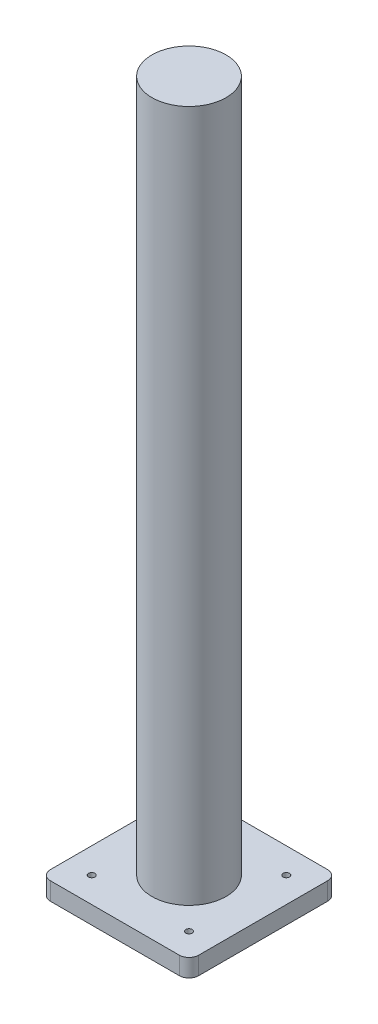
ISO-10303-21;
HEADER;
FILE_DESCRIPTION(('STEP AP214'),'2;1');
FILE_NAME('part.step','',(''),(''),'','','');
FILE_SCHEMA(('AUTOMOTIVE_DESIGN { 1 0 10303 214 1 1 1 1 }'));
ENDSEC;
DATA;
#1=APPLICATION_CONTEXT('core data for automotive mechanical design processes');
#2=APPLICATION_PROTOCOL_DEFINITION('international standard','automotive_design',2000,#1);
#3=PRODUCT_CONTEXT('',#1,'mechanical');
#4=PRODUCT('Part','Part','',(#3));
#5=PRODUCT_RELATED_PRODUCT_CATEGORY('part','',(#4));
#6=PRODUCT_DEFINITION_FORMATION('','',#4);
#7=PRODUCT_DEFINITION_CONTEXT('part definition',#1,'design');
#8=PRODUCT_DEFINITION('design','',#6,#7);
#9=PRODUCT_DEFINITION_SHAPE('','',#8);
#10=(LENGTH_UNIT() NAMED_UNIT(*) SI_UNIT(.MILLI.,.METRE.));
#11=(NAMED_UNIT(*) PLANE_ANGLE_UNIT() SI_UNIT($,.RADIAN.));
#12=(NAMED_UNIT(*) SI_UNIT($,.STERADIAN.) SOLID_ANGLE_UNIT());
#13=UNCERTAINTY_MEASURE_WITH_UNIT(LENGTH_MEASURE(1.E-05),#10,'distance_accuracy_value','');
#14=(GEOMETRIC_REPRESENTATION_CONTEXT(3) GLOBAL_UNCERTAINTY_ASSIGNED_CONTEXT((#13)) GLOBAL_UNIT_ASSIGNED_CONTEXT((#10,
#11,#12)) REPRESENTATION_CONTEXT('',''));
#15=CARTESIAN_POINT('',(0.,0.,0.));
#16=DIRECTION('',(0.,0.,1.));
#17=DIRECTION('',(1.,0.,0.));
#18=AXIS2_PLACEMENT_3D('',#15,#16,#17);
#19=CARTESIAN_POINT('',(0.,0.,0.));
#20=DIRECTION('',(0.,-1.,0.));
#21=DIRECTION('',(0.,0.,-1.));
#22=AXIS2_PLACEMENT_3D('',#19,#20,#21);
#23=PLANE('',#22);
#24=DIRECTION('',(-1.,0.,0.));
#25=VECTOR('',#24,1.);
#26=CARTESIAN_POINT('',(0.,0.,0.));
#27=LINE('',#26,#25);
#28=CARTESIAN_POINT('',(71.2,0.,0.));
#29=VERTEX_POINT('',#28);
#30=CARTESIAN_POINT('',(5.,0.,0.));
#31=VERTEX_POINT('',#30);
#32=EDGE_CURVE('E108',#29,#31,#27,.T.);
#33=ORIENTED_EDGE('',*,*,#32,.T.);
#34=CARTESIAN_POINT('',(5.,0.,-5.));
#35=DIRECTION('',(0.,-1.,0.));
#36=DIRECTION('',(0.,0.,-1.));
#37=AXIS2_PLACEMENT_3D('',#34,#35,#36);
#38=CIRCLE('',#37,5.);
#39=CARTESIAN_POINT('',(0.,0.,-5.));
#40=VERTEX_POINT('',#39);
#41=EDGE_CURVE('E140',#40,#31,#38,.F.);
#42=ORIENTED_EDGE('',*,*,#41,.F.);
#43=DIRECTION('',(0.,0.,-1.));
#44=VECTOR('',#43,1.);
#45=CARTESIAN_POINT('',(0.,0.,0.));
#46=LINE('',#45,#44);
#47=CARTESIAN_POINT('',(0.,0.,-71.2));
#48=VERTEX_POINT('',#47);
#49=EDGE_CURVE('E139',#40,#48,#46,.T.);
#50=ORIENTED_EDGE('',*,*,#49,.T.);
#51=CARTESIAN_POINT('',(5.,0.,-71.2));
#52=DIRECTION('',(0.,-1.,0.));
#53=DIRECTION('',(0.,0.,-1.));
#54=AXIS2_PLACEMENT_3D('',#51,#52,#53);
#55=CIRCLE('',#54,5.);
#56=CARTESIAN_POINT('',(5.,0.,-76.2));
#57=VERTEX_POINT('',#56);
#58=EDGE_CURVE('E135',#57,#48,#55,.F.);
#59=ORIENTED_EDGE('',*,*,#58,.F.);
#60=DIRECTION('',(1.,0.,0.));
#61=VECTOR('',#60,1.);
#62=CARTESIAN_POINT('',(0.,0.,-76.2));
#63=LINE('',#62,#61);
#64=CARTESIAN_POINT('',(71.2,0.,-76.2));
#65=VERTEX_POINT('',#64);
#66=EDGE_CURVE('E87',#57,#65,#63,.T.);
#67=ORIENTED_EDGE('',*,*,#66,.T.);
#68=CARTESIAN_POINT('',(71.2,0.,-71.2));
#69=DIRECTION('',(0.,-1.,0.));
#70=DIRECTION('',(0.,0.,-1.));
#71=AXIS2_PLACEMENT_3D('',#68,#69,#70);
#72=CIRCLE('',#71,5.);
#73=CARTESIAN_POINT('',(76.2,0.,-71.2));
#74=VERTEX_POINT('',#73);
#75=EDGE_CURVE('E80',#74,#65,#72,.F.);
#76=ORIENTED_EDGE('',*,*,#75,.F.);
#77=DIRECTION('',(0.,0.,1.));
#78=VECTOR('',#77,1.);
#79=CARTESIAN_POINT('',(76.2,0.,0.));
#80=LINE('',#79,#78);
#81=CARTESIAN_POINT('',(76.2,0.,-5.));
#82=VERTEX_POINT('',#81);
#83=EDGE_CURVE('E84',#74,#82,#80,.T.);
#84=ORIENTED_EDGE('',*,*,#83,.T.);
#85=CARTESIAN_POINT('',(71.2,0.,-5.));
#86=DIRECTION('',(0.,-1.,0.));
#87=DIRECTION('',(0.,0.,-1.));
#88=AXIS2_PLACEMENT_3D('',#85,#86,#87);
#89=CIRCLE('',#88,5.);
#90=EDGE_CURVE('E104',#29,#82,#89,.F.);
#91=ORIENTED_EDGE('',*,*,#90,.F.);
#92=EDGE_LOOP('',(#33,#42,#50,#59,#67,#76,#84,#91));
#93=FACE_BOUND('',#92,.T.);
#94=CARTESIAN_POINT('',(63.1,0.,-63.1));
#95=DIRECTION('',(0.,1.,0.));
#96=DIRECTION('',(0.,0.,1.));
#97=AXIS2_PLACEMENT_3D('',#94,#95,#96);
#98=CIRCLE('',#97,1.65);
#99=CARTESIAN_POINT('',(63.1,0.,-61.45));
#100=VERTEX_POINT('',#99);
#101=EDGE_CURVE('E91',#100,#100,#98,.T.);
#102=ORIENTED_EDGE('',*,*,#101,.T.);
#103=EDGE_LOOP('',(#102));
#104=FACE_BOUND('',#103,.T.);
#105=CARTESIAN_POINT('',(13.1,0.,-13.1));
#106=DIRECTION('',(0.,1.,0.));
#107=DIRECTION('',(0.,0.,1.));
#108=AXIS2_PLACEMENT_3D('',#105,#106,#107);
#109=CIRCLE('',#108,1.65);
#110=CARTESIAN_POINT('',(13.1,0.,-11.45));
#111=VERTEX_POINT('',#110);
#112=EDGE_CURVE('E146',#111,#111,#109,.T.);
#113=ORIENTED_EDGE('',*,*,#112,.T.);
#114=EDGE_LOOP('',(#113));
#115=FACE_BOUND('',#114,.T.);
#116=CARTESIAN_POINT('',(63.1,0.,-13.1));
#117=DIRECTION('',(0.,1.,0.));
#118=DIRECTION('',(0.,0.,1.));
#119=AXIS2_PLACEMENT_3D('',#116,#117,#118);
#120=CIRCLE('',#119,1.65);
#121=CARTESIAN_POINT('',(63.1,0.,-11.45));
#122=VERTEX_POINT('',#121);
#123=EDGE_CURVE('E148',#122,#122,#120,.T.);
#124=ORIENTED_EDGE('',*,*,#123,.T.);
#125=EDGE_LOOP('',(#124));
#126=FACE_BOUND('',#125,.T.);
#127=CARTESIAN_POINT('',(13.1,0.,-63.1));
#128=DIRECTION('',(0.,1.,0.));
#129=DIRECTION('',(0.,0.,1.));
#130=AXIS2_PLACEMENT_3D('',#127,#128,#129);
#131=CIRCLE('',#130,1.65);
#132=CARTESIAN_POINT('',(13.1,0.,-61.45));
#133=VERTEX_POINT('',#132);
#134=EDGE_CURVE('E20',#133,#133,#131,.T.);
#135=ORIENTED_EDGE('',*,*,#134,.T.);
#136=EDGE_LOOP('',(#135));
#137=FACE_BOUND('',#136,.T.);
#138=ADVANCED_FACE('F17',(#93,#104,#115,#126,#137),#23,.T.);
#139=CARTESIAN_POINT('',(13.1,0.,-63.1));
#140=DIRECTION('',(0.,1.,0.));
#141=DIRECTION('',(0.,0.,1.));
#142=AXIS2_PLACEMENT_3D('',#139,#140,#141);
#143=CYLINDRICAL_SURFACE('',#142,1.65);
#144=ORIENTED_EDGE('',*,*,#134,.F.);
#145=EDGE_LOOP('',(#144));
#146=FACE_BOUND('',#145,.T.);
#147=CARTESIAN_POINT('',(13.1,9.144,-63.1));
#148=DIRECTION('',(0.,1.,0.));
#149=DIRECTION('',(0.,0.,1.));
#150=AXIS2_PLACEMENT_3D('',#147,#148,#149);
#151=CIRCLE('',#150,1.65);
#152=CARTESIAN_POINT('',(13.1,9.144,-61.45));
#153=VERTEX_POINT('',#152);
#154=EDGE_CURVE('E132',#153,#153,#151,.T.);
#155=ORIENTED_EDGE('',*,*,#154,.T.);
#156=EDGE_LOOP('',(#155));
#157=FACE_BOUND('',#156,.T.);
#158=ADVANCED_FACE('F156',(#146,#157),#143,.F.);
#159=CARTESIAN_POINT('',(63.1,0.,-13.1));
#160=DIRECTION('',(0.,1.,0.));
#161=DIRECTION('',(0.,0.,1.));
#162=AXIS2_PLACEMENT_3D('',#159,#160,#161);
#163=CYLINDRICAL_SURFACE('',#162,1.65);
#164=ORIENTED_EDGE('',*,*,#123,.F.);
#165=EDGE_LOOP('',(#164));
#166=FACE_BOUND('',#165,.T.);
#167=CARTESIAN_POINT('',(63.1,9.144,-13.1));
#168=DIRECTION('',(0.,1.,0.));
#169=DIRECTION('',(0.,0.,1.));
#170=AXIS2_PLACEMENT_3D('',#167,#168,#169);
#171=CIRCLE('',#170,1.65);
#172=CARTESIAN_POINT('',(63.1,9.144,-11.45));
#173=VERTEX_POINT('',#172);
#174=EDGE_CURVE('E129',#173,#173,#171,.T.);
#175=ORIENTED_EDGE('',*,*,#174,.T.);
#176=EDGE_LOOP('',(#175));
#177=FACE_BOUND('',#176,.T.);
#178=ADVANCED_FACE('F159',(#166,#177),#163,.F.);
#179=CARTESIAN_POINT('',(13.1,0.,-13.1));
#180=DIRECTION('',(0.,1.,0.));
#181=DIRECTION('',(0.,0.,1.));
#182=AXIS2_PLACEMENT_3D('',#179,#180,#181);
#183=CYLINDRICAL_SURFACE('',#182,1.65);
#184=ORIENTED_EDGE('',*,*,#112,.F.);
#185=EDGE_LOOP('',(#184));
#186=FACE_BOUND('',#185,.T.);
#187=CARTESIAN_POINT('',(13.1,9.144,-13.1));
#188=DIRECTION('',(0.,1.,0.));
#189=DIRECTION('',(0.,0.,1.));
#190=AXIS2_PLACEMENT_3D('',#187,#188,#189);
#191=CIRCLE('',#190,1.65);
#192=CARTESIAN_POINT('',(13.1,9.144,-11.45));
#193=VERTEX_POINT('',#192);
#194=EDGE_CURVE('E126',#193,#193,#191,.T.);
#195=ORIENTED_EDGE('',*,*,#194,.T.);
#196=EDGE_LOOP('',(#195));
#197=FACE_BOUND('',#196,.T.);
#198=ADVANCED_FACE('F212',(#186,#197),#183,.F.);
#199=CARTESIAN_POINT('',(63.1,0.,-63.1));
#200=DIRECTION('',(0.,1.,0.));
#201=DIRECTION('',(0.,0.,1.));
#202=AXIS2_PLACEMENT_3D('',#199,#200,#201);
#203=CYLINDRICAL_SURFACE('',#202,1.65);
#204=ORIENTED_EDGE('',*,*,#101,.F.);
#205=EDGE_LOOP('',(#204));
#206=FACE_BOUND('',#205,.T.);
#207=CARTESIAN_POINT('',(63.1,9.144,-63.1));
#208=DIRECTION('',(0.,1.,0.));
#209=DIRECTION('',(0.,0.,1.));
#210=AXIS2_PLACEMENT_3D('',#207,#208,#209);
#211=CIRCLE('',#210,1.65);
#212=CARTESIAN_POINT('',(63.1,9.144,-61.45));
#213=VERTEX_POINT('',#212);
#214=EDGE_CURVE('E123',#213,#213,#211,.T.);
#215=ORIENTED_EDGE('',*,*,#214,.T.);
#216=EDGE_LOOP('',(#215));
#217=FACE_BOUND('',#216,.T.);
#218=ADVANCED_FACE('F209',(#206,#217),#203,.F.);
#219=CARTESIAN_POINT('',(71.2,9.144,-71.2));
#220=DIRECTION('',(0.,-1.,0.));
#221=DIRECTION('',(0.,0.,-1.));
#222=AXIS2_PLACEMENT_3D('',#219,#220,#221);
#223=CYLINDRICAL_SURFACE('',#222,5.);
#224=ORIENTED_EDGE('',*,*,#75,.T.);
#225=DIRECTION('',(0.,1.,0.));
#226=VECTOR('',#225,1.);
#227=CARTESIAN_POINT('',(71.2,9.144,-76.2));
#228=LINE('',#227,#226);
#229=CARTESIAN_POINT('',(71.2,9.144,-76.2));
#230=VERTEX_POINT('',#229);
#231=EDGE_CURVE('E356',#65,#230,#228,.T.);
#232=ORIENTED_EDGE('',*,*,#231,.T.);
#233=CARTESIAN_POINT('',(71.2,9.144,-71.2));
#234=DIRECTION('',(0.,-1.,0.));
#235=DIRECTION('',(0.,0.,-1.));
#236=AXIS2_PLACEMENT_3D('',#233,#234,#235);
#237=CIRCLE('',#236,5.);
#238=CARTESIAN_POINT('',(76.2,9.144,-71.2));
#239=VERTEX_POINT('',#238);
#240=EDGE_CURVE('E96',#230,#239,#237,.T.);
#241=ORIENTED_EDGE('',*,*,#240,.T.);
#242=DIRECTION('',(0.,1.,0.));
#243=VECTOR('',#242,1.);
#244=CARTESIAN_POINT('',(76.2,9.144,-71.2));
#245=LINE('',#244,#243);
#246=EDGE_CURVE('E90',#239,#74,#245,.F.);
#247=ORIENTED_EDGE('',*,*,#246,.T.);
#248=EDGE_LOOP('',(#224,#232,#241,#247));
#249=FACE_BOUND('',#248,.T.);
#250=ADVANCED_FACE('F94',(#249),#223,.T.);
#251=CARTESIAN_POINT('',(76.2,9.144,0.));
#252=DIRECTION('',(-1.,0.,0.));
#253=DIRECTION('',(0.,0.,1.));
#254=AXIS2_PLACEMENT_3D('',#251,#252,#253);
#255=PLANE('',#254);
#256=ORIENTED_EDGE('',*,*,#246,.F.);
#257=DIRECTION('',(0.,0.,-1.));
#258=VECTOR('',#257,1.);
#259=CARTESIAN_POINT('',(76.2,9.144,0.));
#260=LINE('',#259,#258);
#261=CARTESIAN_POINT('',(76.2,9.144,-5.));
#262=VERTEX_POINT('',#261);
#263=EDGE_CURVE('E121',#239,#262,#260,.F.);
#264=ORIENTED_EDGE('',*,*,#263,.T.);
#265=DIRECTION('',(0.,-1.,0.));
#266=VECTOR('',#265,1.);
#267=CARTESIAN_POINT('',(76.2,9.144,-5.));
#268=LINE('',#267,#266);
#269=EDGE_CURVE('E102',#82,#262,#268,.F.);
#270=ORIENTED_EDGE('',*,*,#269,.F.);
#271=ORIENTED_EDGE('',*,*,#83,.F.);
#272=EDGE_LOOP('',(#256,#264,#270,#271));
#273=FACE_BOUND('',#272,.T.);
#274=ADVANCED_FACE('F100',(#273),#255,.F.);
#275=CARTESIAN_POINT('',(71.2,9.144,-5.));
#276=DIRECTION('',(0.,-1.,0.));
#277=DIRECTION('',(0.,0.,-1.));
#278=AXIS2_PLACEMENT_3D('',#275,#276,#277);
#279=CYLINDRICAL_SURFACE('',#278,5.);
#280=ORIENTED_EDGE('',*,*,#90,.T.);
#281=ORIENTED_EDGE('',*,*,#269,.T.);
#282=CARTESIAN_POINT('',(71.2,9.144,-5.));
#283=DIRECTION('',(0.,-1.,0.));
#284=DIRECTION('',(0.,0.,-1.));
#285=AXIS2_PLACEMENT_3D('',#282,#283,#284);
#286=CIRCLE('',#285,5.);
#287=CARTESIAN_POINT('',(71.2,9.144,0.));
#288=VERTEX_POINT('',#287);
#289=EDGE_CURVE('E119',#262,#288,#286,.T.);
#290=ORIENTED_EDGE('',*,*,#289,.T.);
#291=DIRECTION('',(0.,1.,0.));
#292=VECTOR('',#291,1.);
#293=CARTESIAN_POINT('',(71.2,9.144,0.));
#294=LINE('',#293,#292);
#295=EDGE_CURVE('E336',#288,#29,#294,.F.);
#296=ORIENTED_EDGE('',*,*,#295,.T.);
#297=EDGE_LOOP('',(#280,#281,#290,#296));
#298=FACE_BOUND('',#297,.T.);
#299=ADVANCED_FACE('F200',(#298),#279,.T.);
#300=CARTESIAN_POINT('',(0.,9.144,0.));
#301=DIRECTION('',(0.,0.,-1.));
#302=DIRECTION('',(-1.,0.,0.));
#303=AXIS2_PLACEMENT_3D('',#300,#301,#302);
#304=PLANE('',#303);
#305=ORIENTED_EDGE('',*,*,#295,.F.);
#306=DIRECTION('',(1.,0.,0.));
#307=VECTOR('',#306,1.);
#308=CARTESIAN_POINT('',(0.,9.144,0.));
#309=LINE('',#308,#307);
#310=CARTESIAN_POINT('',(5.,9.144,0.));
#311=VERTEX_POINT('',#310);
#312=EDGE_CURVE('E118',#288,#311,#309,.F.);
#313=ORIENTED_EDGE('',*,*,#312,.T.);
#314=DIRECTION('',(0.,-1.,0.));
#315=VECTOR('',#314,1.);
#316=CARTESIAN_POINT('',(5.,9.144,0.));
#317=LINE('',#316,#315);
#318=EDGE_CURVE('E142',#31,#311,#317,.F.);
#319=ORIENTED_EDGE('',*,*,#318,.F.);
#320=ORIENTED_EDGE('',*,*,#32,.F.);
#321=EDGE_LOOP('',(#305,#313,#319,#320));
#322=FACE_BOUND('',#321,.T.);
#323=ADVANCED_FACE('F196',(#322),#304,.F.);
#324=CARTESIAN_POINT('',(5.,9.144,-5.));
#325=DIRECTION('',(0.,-1.,0.));
#326=DIRECTION('',(0.,0.,-1.));
#327=AXIS2_PLACEMENT_3D('',#324,#325,#326);
#328=CYLINDRICAL_SURFACE('',#327,5.);
#329=ORIENTED_EDGE('',*,*,#41,.T.);
#330=ORIENTED_EDGE('',*,*,#318,.T.);
#331=CARTESIAN_POINT('',(5.,9.144,-5.));
#332=DIRECTION('',(0.,-1.,0.));
#333=DIRECTION('',(0.,0.,-1.));
#334=AXIS2_PLACEMENT_3D('',#331,#332,#333);
#335=CIRCLE('',#334,5.);
#336=CARTESIAN_POINT('',(0.,9.144,-5.));
#337=VERTEX_POINT('',#336);
#338=EDGE_CURVE('E116',#311,#337,#335,.T.);
#339=ORIENTED_EDGE('',*,*,#338,.T.);
#340=DIRECTION('',(0.,1.,0.));
#341=VECTOR('',#340,1.);
#342=CARTESIAN_POINT('',(0.,9.144,-5.));
#343=LINE('',#342,#341);
#344=EDGE_CURVE('E343',#337,#40,#343,.F.);
#345=ORIENTED_EDGE('',*,*,#344,.T.);
#346=EDGE_LOOP('',(#329,#330,#339,#345));
#347=FACE_BOUND('',#346,.T.);
#348=ADVANCED_FACE('F192',(#347),#328,.T.);
#349=CARTESIAN_POINT('',(0.,9.144,0.));
#350=DIRECTION('',(1.,0.,0.));
#351=DIRECTION('',(0.,0.,-1.));
#352=AXIS2_PLACEMENT_3D('',#349,#350,#351);
#353=PLANE('',#352);
#354=DIRECTION('',(0.,-1.,0.));
#355=VECTOR('',#354,1.);
#356=CARTESIAN_POINT('',(0.,9.144,-71.2));
#357=LINE('',#356,#355);
#358=CARTESIAN_POINT('',(0.,9.144,-71.2));
#359=VERTEX_POINT('',#358);
#360=EDGE_CURVE('E138',#48,#359,#357,.F.);
#361=ORIENTED_EDGE('',*,*,#360,.F.);
#362=ORIENTED_EDGE('',*,*,#49,.F.);
#363=ORIENTED_EDGE('',*,*,#344,.F.);
#364=DIRECTION('',(0.,0.,-1.));
#365=VECTOR('',#364,1.);
#366=CARTESIAN_POINT('',(0.,9.144,0.));
#367=LINE('',#366,#365);
#368=EDGE_CURVE('E115',#337,#359,#367,.T.);
#369=ORIENTED_EDGE('',*,*,#368,.T.);
#370=EDGE_LOOP('',(#361,#362,#363,#369));
#371=FACE_BOUND('',#370,.T.);
#372=ADVANCED_FACE('F189',(#371),#353,.F.);
#373=CARTESIAN_POINT('',(5.,9.144,-71.2));
#374=DIRECTION('',(0.,-1.,0.));
#375=DIRECTION('',(0.,0.,-1.));
#376=AXIS2_PLACEMENT_3D('',#373,#374,#375);
#377=CYLINDRICAL_SURFACE('',#376,5.);
#378=ORIENTED_EDGE('',*,*,#58,.T.);
#379=ORIENTED_EDGE('',*,*,#360,.T.);
#380=CARTESIAN_POINT('',(5.,9.144,-71.2));
#381=DIRECTION('',(0.,-1.,0.));
#382=DIRECTION('',(0.,0.,-1.));
#383=AXIS2_PLACEMENT_3D('',#380,#381,#382);
#384=CIRCLE('',#383,5.);
#385=CARTESIAN_POINT('',(5.,9.144,-76.2));
#386=VERTEX_POINT('',#385);
#387=EDGE_CURVE('E35',#359,#386,#384,.T.);
#388=ORIENTED_EDGE('',*,*,#387,.T.);
#389=DIRECTION('',(0.,1.,0.));
#390=VECTOR('',#389,1.);
#391=CARTESIAN_POINT('',(5.,9.144,-76.2));
#392=LINE('',#391,#390);
#393=EDGE_CURVE('E351',#386,#57,#392,.F.);
#394=ORIENTED_EDGE('',*,*,#393,.T.);
#395=EDGE_LOOP('',(#378,#379,#388,#394));
#396=FACE_BOUND('',#395,.T.);
#397=ADVANCED_FACE('F183',(#396),#377,.T.);
#398=CARTESIAN_POINT('',(0.,9.144,-76.2));
#399=DIRECTION('',(0.,0.,1.));
#400=DIRECTION('',(1.,0.,0.));
#401=AXIS2_PLACEMENT_3D('',#398,#399,#400);
#402=PLANE('',#401);
#403=ORIENTED_EDGE('',*,*,#393,.F.);
#404=DIRECTION('',(1.,0.,0.));
#405=VECTOR('',#404,1.);
#406=CARTESIAN_POINT('',(0.,9.144,-76.2));
#407=LINE('',#406,#405);
#408=EDGE_CURVE('E113',#386,#230,#407,.T.);
#409=ORIENTED_EDGE('',*,*,#408,.T.);
#410=ORIENTED_EDGE('',*,*,#231,.F.);
#411=ORIENTED_EDGE('',*,*,#66,.F.);
#412=EDGE_LOOP('',(#403,#409,#410,#411));
#413=FACE_BOUND('',#412,.T.);
#414=ADVANCED_FACE('F177',(#413),#402,.F.);
#415=CARTESIAN_POINT('',(38.1,364.744,-38.1));
#416=DIRECTION('',(0.,1.,0.));
#417=DIRECTION('',(0.,0.,1.));
#418=AXIS2_PLACEMENT_3D('',#415,#416,#417);
#419=PLANE('',#418);
#420=CARTESIAN_POINT('',(38.1,364.744,-38.1));
#421=DIRECTION('',(0.,-1.,0.));
#422=DIRECTION('',(0.,0.,-1.));
#423=AXIS2_PLACEMENT_3D('',#420,#421,#422);
#424=CIRCLE('',#423,19.05);
#425=CARTESIAN_POINT('',(38.1,364.744,-57.15));
#426=VERTEX_POINT('',#425);
#427=EDGE_CURVE('E26',#426,#426,#424,.T.);
#428=ORIENTED_EDGE('',*,*,#427,.F.);
#429=EDGE_LOOP('',(#428));
#430=FACE_BOUND('',#429,.T.);
#431=ADVANCED_FACE('F166',(#430),#419,.T.);
#432=CARTESIAN_POINT('',(0.,9.144,0.));
#433=DIRECTION('',(0.,-1.,0.));
#434=DIRECTION('',(0.,0.,-1.));
#435=AXIS2_PLACEMENT_3D('',#432,#433,#434);
#436=PLANE('',#435);
#437=ORIENTED_EDGE('',*,*,#387,.F.);
#438=ORIENTED_EDGE('',*,*,#368,.F.);
#439=ORIENTED_EDGE('',*,*,#338,.F.);
#440=ORIENTED_EDGE('',*,*,#312,.F.);
#441=ORIENTED_EDGE('',*,*,#289,.F.);
#442=ORIENTED_EDGE('',*,*,#263,.F.);
#443=ORIENTED_EDGE('',*,*,#240,.F.);
#444=ORIENTED_EDGE('',*,*,#408,.F.);
#445=EDGE_LOOP('',(#437,#438,#439,#440,#441,#442,#443,#444));
#446=FACE_BOUND('',#445,.T.);
#447=ORIENTED_EDGE('',*,*,#214,.F.);
#448=EDGE_LOOP('',(#447));
#449=FACE_BOUND('',#448,.T.);
#450=ORIENTED_EDGE('',*,*,#194,.F.);
#451=EDGE_LOOP('',(#450));
#452=FACE_BOUND('',#451,.T.);
#453=ORIENTED_EDGE('',*,*,#174,.F.);
#454=EDGE_LOOP('',(#453));
#455=FACE_BOUND('',#454,.T.);
#456=ORIENTED_EDGE('',*,*,#154,.F.);
#457=EDGE_LOOP('',(#456));
#458=FACE_BOUND('',#457,.T.);
#459=CARTESIAN_POINT('',(38.1,9.14399999999999,-38.1));
#460=DIRECTION('',(0.,-1.,0.));
#461=DIRECTION('',(0.,0.,-1.));
#462=AXIS2_PLACEMENT_3D('',#459,#460,#461);
#463=CIRCLE('',#462,19.05);
#464=CARTESIAN_POINT('',(38.1,9.14399999999999,-57.15));
#465=VERTEX_POINT('',#464);
#466=EDGE_CURVE('E11',#465,#465,#463,.F.);
#467=ORIENTED_EDGE('',*,*,#466,.F.);
#468=EDGE_LOOP('',(#467));
#469=FACE_BOUND('',#468,.T.);
#470=ADVANCED_FACE('F162',(#446,#449,#452,#455,#458,#469),#436,.F.);
#471=CARTESIAN_POINT('',(38.1,364.744,-38.1));
#472=DIRECTION('',(0.,-1.,0.));
#473=DIRECTION('',(0.,0.,-1.));
#474=AXIS2_PLACEMENT_3D('',#471,#472,#473);
#475=CYLINDRICAL_SURFACE('',#474,19.05);
#476=ORIENTED_EDGE('',*,*,#466,.T.);
#477=EDGE_LOOP('',(#476));
#478=FACE_BOUND('',#477,.T.);
#479=ORIENTED_EDGE('',*,*,#427,.T.);
#480=EDGE_LOOP('',(#479));
#481=FACE_BOUND('',#480,.T.);
#482=ADVANCED_FACE('F165',(#478,#481),#475,.T.);
#483=CLOSED_SHELL('',(#138,#158,#178,#198,#218,#250,#274,#299,#323,#348,#372,#397,#414,#431,
#470,#482));
#484=MANIFOLD_SOLID_BREP('B1',#483);
#485=ADVANCED_BREP_SHAPE_REPRESENTATION('',(#18,#484),#14);
#486=SHAPE_DEFINITION_REPRESENTATION(#9,#485);
ENDSEC;
END-ISO-10303-21;
